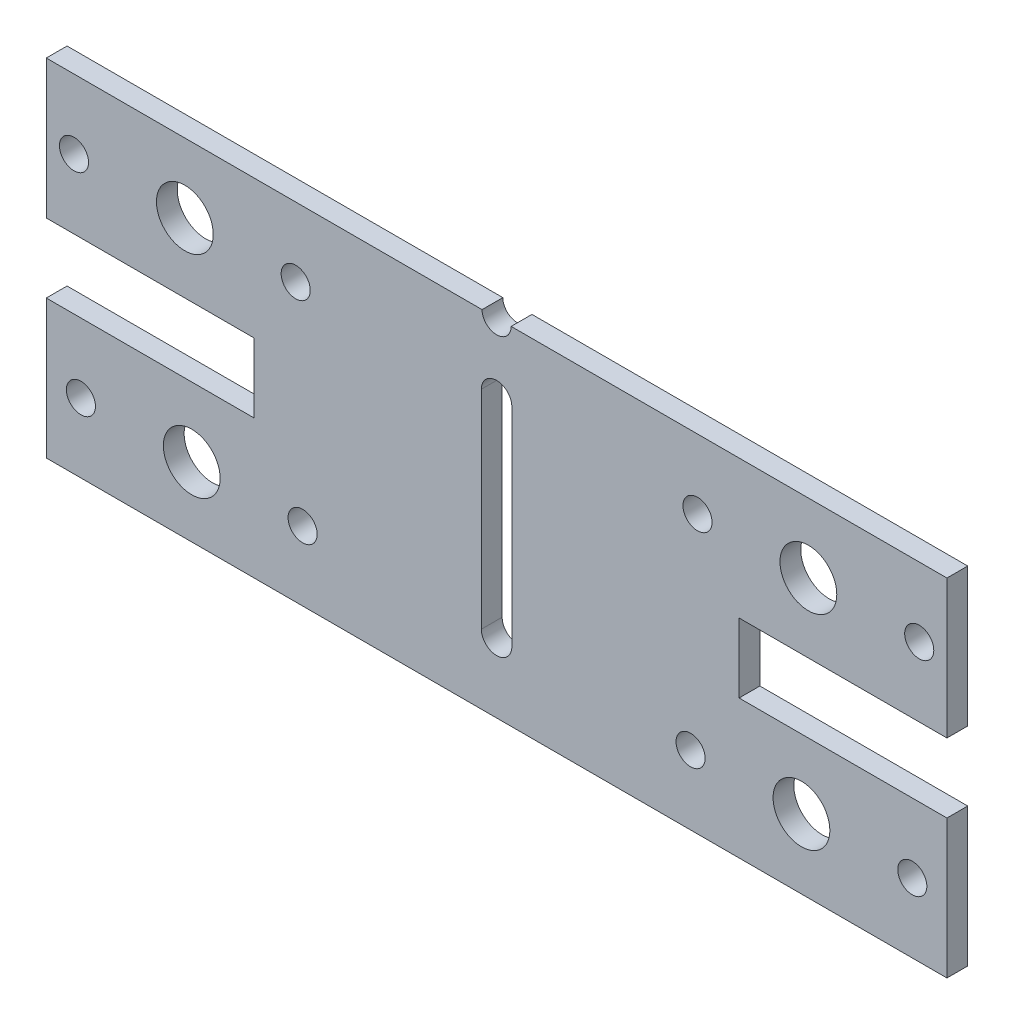
ISO-10303-21;
HEADER;
FILE_DESCRIPTION(('STEP AP214'),'2;1');
FILE_NAME('part.step','',(''),(''),'','','');
FILE_SCHEMA(('AUTOMOTIVE_DESIGN { 1 0 10303 214 1 1 1 1 }'));
ENDSEC;
DATA;
#1=APPLICATION_CONTEXT('core data for automotive mechanical design processes');
#2=APPLICATION_PROTOCOL_DEFINITION('international standard','automotive_design',2000,#1);
#3=PRODUCT_CONTEXT('',#1,'mechanical');
#4=PRODUCT('Part','Part','',(#3));
#5=PRODUCT_RELATED_PRODUCT_CATEGORY('part','',(#4));
#6=PRODUCT_DEFINITION_FORMATION('','',#4);
#7=PRODUCT_DEFINITION_CONTEXT('part definition',#1,'design');
#8=PRODUCT_DEFINITION('design','',#6,#7);
#9=PRODUCT_DEFINITION_SHAPE('','',#8);
#10=(LENGTH_UNIT() NAMED_UNIT(*) SI_UNIT(.MILLI.,.METRE.));
#11=(NAMED_UNIT(*) PLANE_ANGLE_UNIT() SI_UNIT($,.RADIAN.));
#12=(NAMED_UNIT(*) SI_UNIT($,.STERADIAN.) SOLID_ANGLE_UNIT());
#13=UNCERTAINTY_MEASURE_WITH_UNIT(LENGTH_MEASURE(1.E-05),#10,'distance_accuracy_value','');
#14=(GEOMETRIC_REPRESENTATION_CONTEXT(3) GLOBAL_UNCERTAINTY_ASSIGNED_CONTEXT((#13)) GLOBAL_UNIT_ASSIGNED_CONTEXT((#10,
#11,#12)) REPRESENTATION_CONTEXT('',''));
#15=CARTESIAN_POINT('',(0.,0.,0.));
#16=DIRECTION('',(0.,0.,1.));
#17=DIRECTION('',(1.,0.,0.));
#18=AXIS2_PLACEMENT_3D('',#15,#16,#17);
#19=CARTESIAN_POINT('',(0.,0.,3.));
#20=DIRECTION('',(1.,0.,0.));
#21=DIRECTION('',(0.,0.,-1.));
#22=AXIS2_PLACEMENT_3D('',#19,#20,#21);
#23=PLANE('',#22);
#24=DIRECTION('',(0.,-1.,0.));
#25=VECTOR('',#24,1.);
#26=CARTESIAN_POINT('',(0.,0.,3.));
#27=LINE('',#26,#25);
#28=CARTESIAN_POINT('',(0.,20.,3.));
#29=VERTEX_POINT('',#28);
#30=CARTESIAN_POINT('',(0.,0.,3.));
#31=VERTEX_POINT('',#30);
#32=EDGE_CURVE('E199',#29,#31,#27,.T.);
#33=ORIENTED_EDGE('',*,*,#32,.F.);
#34=DIRECTION('',(0.,0.,-1.));
#35=VECTOR('',#34,1.);
#36=CARTESIAN_POINT('',(0.,20.,3.001));
#37=LINE('',#36,#35);
#38=CARTESIAN_POINT('',(0.,20.,0.));
#39=VERTEX_POINT('',#38);
#40=EDGE_CURVE('E385',#29,#39,#37,.T.);
#41=ORIENTED_EDGE('',*,*,#40,.T.);
#42=DIRECTION('',(0.,-1.,0.));
#43=VECTOR('',#42,1.);
#44=CARTESIAN_POINT('',(0.,0.,0.));
#45=LINE('',#44,#43);
#46=CARTESIAN_POINT('',(0.,0.,0.));
#47=VERTEX_POINT('',#46);
#48=EDGE_CURVE('E183',#39,#47,#45,.T.);
#49=ORIENTED_EDGE('',*,*,#48,.T.);
#50=DIRECTION('',(0.,0.,-1.));
#51=VECTOR('',#50,1.);
#52=CARTESIAN_POINT('',(0.,0.,3.));
#53=LINE('',#52,#51);
#54=EDGE_CURVE('E11',#31,#47,#53,.T.);
#55=ORIENTED_EDGE('',*,*,#54,.F.);
#56=EDGE_LOOP('',(#33,#41,#49,#55));
#57=FACE_BOUND('',#56,.T.);
#58=ADVANCED_FACE('F33',(#57),#23,.F.);
#59=CARTESIAN_POINT('',(130.,0.,3.));
#60=DIRECTION('',(-1.,0.,0.));
#61=DIRECTION('',(0.,0.,1.));
#62=AXIS2_PLACEMENT_3D('',#59,#60,#61);
#63=PLANE('',#62);
#64=DIRECTION('',(0.,1.,0.));
#65=VECTOR('',#64,1.);
#66=CARTESIAN_POINT('',(130.,0.,3.));
#67=LINE('',#66,#65);
#68=CARTESIAN_POINT('',(130.,30.,3.));
#69=VERTEX_POINT('',#68);
#70=CARTESIAN_POINT('',(130.,50.,3.));
#71=VERTEX_POINT('',#70);
#72=EDGE_CURVE('E357',#69,#71,#67,.T.);
#73=ORIENTED_EDGE('',*,*,#72,.F.);
#74=DIRECTION('',(0.,0.,-1.));
#75=VECTOR('',#74,1.);
#76=CARTESIAN_POINT('',(130.,30.,3.001));
#77=LINE('',#76,#75);
#78=CARTESIAN_POINT('',(130.,30.,0.));
#79=VERTEX_POINT('',#78);
#80=EDGE_CURVE('E233',#69,#79,#77,.T.);
#81=ORIENTED_EDGE('',*,*,#80,.T.);
#82=DIRECTION('',(0.,1.,0.));
#83=VECTOR('',#82,1.);
#84=CARTESIAN_POINT('',(130.,0.,0.));
#85=LINE('',#84,#83);
#86=CARTESIAN_POINT('',(130.,50.,0.));
#87=VERTEX_POINT('',#86);
#88=EDGE_CURVE('E185',#79,#87,#85,.T.);
#89=ORIENTED_EDGE('',*,*,#88,.T.);
#90=DIRECTION('',(0.,0.,-1.));
#91=VECTOR('',#90,1.);
#92=CARTESIAN_POINT('',(130.,50.,3.));
#93=LINE('',#92,#91);
#94=EDGE_CURVE('E201',#71,#87,#93,.T.);
#95=ORIENTED_EDGE('',*,*,#94,.F.);
#96=EDGE_LOOP('',(#73,#81,#89,#95));
#97=FACE_BOUND('',#96,.T.);
#98=ADVANCED_FACE('F371',(#97),#63,.F.);
#99=CARTESIAN_POINT('',(0.,50.,3.));
#100=DIRECTION('',(0.,-1.,0.));
#101=DIRECTION('',(0.,0.,-1.));
#102=AXIS2_PLACEMENT_3D('',#99,#100,#101);
#103=PLANE('',#102);
#104=DIRECTION('',(-1.,0.,0.));
#105=VECTOR('',#104,1.);
#106=CARTESIAN_POINT('',(0.,50.,3.));
#107=LINE('',#106,#105);
#108=CARTESIAN_POINT('',(62.9,50.,3.));
#109=VERTEX_POINT('',#108);
#110=CARTESIAN_POINT('',(0.,50.,3.));
#111=VERTEX_POINT('',#110);
#112=EDGE_CURVE('E358',#109,#111,#107,.T.);
#113=ORIENTED_EDGE('',*,*,#112,.F.);
#114=DIRECTION('',(0.,0.,-1.));
#115=VECTOR('',#114,1.);
#116=CARTESIAN_POINT('',(62.9,50.,3.001));
#117=LINE('',#116,#115);
#118=CARTESIAN_POINT('',(62.9,50.,0.));
#119=VERTEX_POINT('',#118);
#120=EDGE_CURVE('E247',#109,#119,#117,.T.);
#121=ORIENTED_EDGE('',*,*,#120,.T.);
#122=DIRECTION('',(-1.,0.,0.));
#123=VECTOR('',#122,1.);
#124=CARTESIAN_POINT('',(0.,50.,0.));
#125=LINE('',#124,#123);
#126=CARTESIAN_POINT('',(0.,50.,0.));
#127=VERTEX_POINT('',#126);
#128=EDGE_CURVE('E195',#119,#127,#125,.T.);
#129=ORIENTED_EDGE('',*,*,#128,.T.);
#130=DIRECTION('',(0.,0.,-1.));
#131=VECTOR('',#130,1.);
#132=CARTESIAN_POINT('',(0.,50.,3.));
#133=LINE('',#132,#131);
#134=EDGE_CURVE('E181',#111,#127,#133,.T.);
#135=ORIENTED_EDGE('',*,*,#134,.F.);
#136=EDGE_LOOP('',(#113,#121,#129,#135));
#137=FACE_BOUND('',#136,.T.);
#138=ADVANCED_FACE('F382',(#137),#103,.F.);
#139=CARTESIAN_POINT('',(0.,0.,3.));
#140=DIRECTION('',(0.,0.,-1.));
#141=DIRECTION('',(-1.,0.,0.));
#142=AXIS2_PLACEMENT_3D('',#139,#140,#141);
#143=PLANE('',#142);
#144=CARTESIAN_POINT('',(4.,40.,3.));
#145=DIRECTION('',(0.,0.,1.));
#146=DIRECTION('',(1.,0.,0.));
#147=AXIS2_PLACEMENT_3D('',#144,#145,#146);
#148=CIRCLE('',#147,2.1);
#149=CARTESIAN_POINT('',(6.1,40.,3.));
#150=VERTEX_POINT('',#149);
#151=EDGE_CURVE('E187',#150,#150,#148,.T.);
#152=ORIENTED_EDGE('',*,*,#151,.F.);
#153=EDGE_LOOP('',(#152));
#154=FACE_BOUND('',#153,.T.);
#155=DIRECTION('',(0.,1.,0.));
#156=VECTOR('',#155,1.);
#157=CARTESIAN_POINT('',(30.,20.,3.));
#158=LINE('',#157,#156);
#159=CARTESIAN_POINT('',(30.,20.,3.));
#160=VERTEX_POINT('',#159);
#161=CARTESIAN_POINT('',(30.,30.,3.));
#162=VERTEX_POINT('',#161);
#163=EDGE_CURVE('E242',#160,#162,#158,.T.);
#164=ORIENTED_EDGE('',*,*,#163,.F.);
#165=DIRECTION('',(1.,0.,0.));
#166=VECTOR('',#165,1.);
#167=CARTESIAN_POINT('',(0.,20.,3.));
#168=LINE('',#167,#166);
#169=EDGE_CURVE('E177',#29,#160,#168,.T.);
#170=ORIENTED_EDGE('',*,*,#169,.F.);
#171=ORIENTED_EDGE('',*,*,#32,.T.);
#172=DIRECTION('',(1.,0.,0.));
#173=VECTOR('',#172,1.);
#174=CARTESIAN_POINT('',(0.,0.,3.));
#175=LINE('',#174,#173);
#176=CARTESIAN_POINT('',(130.,0.,3.));
#177=VERTEX_POINT('',#176);
#178=EDGE_CURVE('E356',#31,#177,#175,.T.);
#179=ORIENTED_EDGE('',*,*,#178,.T.);
#180=CARTESIAN_POINT('',(130.,20.,3.));
#181=VERTEX_POINT('',#180);
#182=EDGE_CURVE('E210',#177,#181,#67,.T.);
#183=ORIENTED_EDGE('',*,*,#182,.T.);
#184=DIRECTION('',(1.,0.,0.));
#185=VECTOR('',#184,1.);
#186=CARTESIAN_POINT('',(130.,20.,3.));
#187=LINE('',#186,#185);
#188=CARTESIAN_POINT('',(100.,20.,3.));
#189=VERTEX_POINT('',#188);
#190=EDGE_CURVE('E56',#189,#181,#187,.T.);
#191=ORIENTED_EDGE('',*,*,#190,.F.);
#192=DIRECTION('',(0.,-1.,0.));
#193=VECTOR('',#192,1.);
#194=CARTESIAN_POINT('',(100.,20.,3.));
#195=LINE('',#194,#193);
#196=CARTESIAN_POINT('',(100.,30.,3.));
#197=VERTEX_POINT('',#196);
#198=EDGE_CURVE('E227',#197,#189,#195,.T.);
#199=ORIENTED_EDGE('',*,*,#198,.F.);
#200=DIRECTION('',(-1.,0.,0.));
#201=VECTOR('',#200,1.);
#202=CARTESIAN_POINT('',(130.,30.,3.));
#203=LINE('',#202,#201);
#204=EDGE_CURVE('E222',#69,#197,#203,.T.);
#205=ORIENTED_EDGE('',*,*,#204,.F.);
#206=ORIENTED_EDGE('',*,*,#72,.T.);
#207=CARTESIAN_POINT('',(67.1,50.,3.));
#208=VERTEX_POINT('',#207);
#209=EDGE_CURVE('E189',#71,#208,#107,.T.);
#210=ORIENTED_EDGE('',*,*,#209,.T.);
#211=CARTESIAN_POINT('',(65.,50.,3.));
#212=DIRECTION('',(0.,0.,-1.));
#213=DIRECTION('',(-1.,0.,0.));
#214=AXIS2_PLACEMENT_3D('',#211,#212,#213);
#215=CIRCLE('',#214,2.1);
#216=EDGE_CURVE('E243',#109,#208,#215,.F.);
#217=ORIENTED_EDGE('',*,*,#216,.F.);
#218=ORIENTED_EDGE('',*,*,#112,.T.);
#219=CARTESIAN_POINT('',(0.,30.,3.));
#220=VERTEX_POINT('',#219);
#221=EDGE_CURVE('E354',#111,#220,#27,.T.);
#222=ORIENTED_EDGE('',*,*,#221,.T.);
#223=DIRECTION('',(-1.,0.,0.));
#224=VECTOR('',#223,1.);
#225=CARTESIAN_POINT('',(0.,30.,3.));
#226=LINE('',#225,#224);
#227=EDGE_CURVE('E48',#162,#220,#226,.T.);
#228=ORIENTED_EDGE('',*,*,#227,.F.);
#229=EDGE_LOOP('',(#164,#170,#171,#179,#183,#191,#199,#205,#206,#210,#217,#218,#222,#228));
#230=FACE_BOUND('',#229,.T.);
#231=CARTESIAN_POINT('',(65.,10.,3.));
#232=DIRECTION('',(0.,0.,1.));
#233=DIRECTION('',(1.,0.,0.));
#234=AXIS2_PLACEMENT_3D('',#231,#232,#233);
#235=CIRCLE('',#234,2.19999999999999);
#236=CARTESIAN_POINT('',(62.8,10.,3.));
#237=VERTEX_POINT('',#236);
#238=CARTESIAN_POINT('',(67.2,10.,3.));
#239=VERTEX_POINT('',#238);
#240=EDGE_CURVE('E319',#237,#239,#235,.T.);
#241=ORIENTED_EDGE('',*,*,#240,.F.);
#242=DIRECTION('',(0.,-1.,0.));
#243=VECTOR('',#242,1.);
#244=CARTESIAN_POINT('',(62.8,10.,3.));
#245=LINE('',#244,#243);
#246=CARTESIAN_POINT('',(62.8,40.,3.));
#247=VERTEX_POINT('',#246);
#248=EDGE_CURVE('E327',#247,#237,#245,.T.);
#249=ORIENTED_EDGE('',*,*,#248,.F.);
#250=CARTESIAN_POINT('',(65.,40.,3.));
#251=DIRECTION('',(0.,0.,1.));
#252=DIRECTION('',(1.,0.,0.));
#253=AXIS2_PLACEMENT_3D('',#250,#251,#252);
#254=CIRCLE('',#253,2.19999999999998);
#255=CARTESIAN_POINT('',(67.2,40.,3.));
#256=VERTEX_POINT('',#255);
#257=EDGE_CURVE('E324',#256,#247,#254,.T.);
#258=ORIENTED_EDGE('',*,*,#257,.F.);
#259=DIRECTION('',(0.,1.,0.));
#260=VECTOR('',#259,1.);
#261=CARTESIAN_POINT('',(67.2,10.,3.));
#262=LINE('',#261,#260);
#263=EDGE_CURVE('E321',#239,#256,#262,.T.);
#264=ORIENTED_EDGE('',*,*,#263,.F.);
#265=EDGE_LOOP('',(#241,#249,#258,#264));
#266=FACE_BOUND('',#265,.T.);
#267=CARTESIAN_POINT('',(20.,40.,3.));
#268=DIRECTION('',(0.,0.,1.));
#269=DIRECTION('',(1.,0.,0.));
#270=AXIS2_PLACEMENT_3D('',#267,#268,#269);
#271=CIRCLE('',#270,4.10000000000001);
#272=CARTESIAN_POINT('',(24.1,40.,3.));
#273=VERTEX_POINT('',#272);
#274=EDGE_CURVE('E313',#273,#273,#271,.T.);
#275=ORIENTED_EDGE('',*,*,#274,.F.);
#276=EDGE_LOOP('',(#275));
#277=FACE_BOUND('',#276,.T.);
#278=CARTESIAN_POINT('',(36.,40.,3.));
#279=DIRECTION('',(0.,0.,1.));
#280=DIRECTION('',(1.,0.,0.));
#281=AXIS2_PLACEMENT_3D('',#278,#279,#280);
#282=CIRCLE('',#281,2.1);
#283=CARTESIAN_POINT('',(38.1,40.,3.));
#284=VERTEX_POINT('',#283);
#285=EDGE_CURVE('E307',#284,#284,#282,.T.);
#286=ORIENTED_EDGE('',*,*,#285,.F.);
#287=EDGE_LOOP('',(#286));
#288=FACE_BOUND('',#287,.T.);
#289=CARTESIAN_POINT('',(94.,40.,3.));
#290=DIRECTION('',(0.,0.,1.));
#291=DIRECTION('',(1.,0.,0.));
#292=AXIS2_PLACEMENT_3D('',#289,#290,#291);
#293=CIRCLE('',#292,2.1);
#294=CARTESIAN_POINT('',(96.1,40.,3.));
#295=VERTEX_POINT('',#294);
#296=EDGE_CURVE('E301',#295,#295,#293,.T.);
#297=ORIENTED_EDGE('',*,*,#296,.F.);
#298=EDGE_LOOP('',(#297));
#299=FACE_BOUND('',#298,.T.);
#300=CARTESIAN_POINT('',(110.,40.,3.));
#301=DIRECTION('',(0.,0.,1.));
#302=DIRECTION('',(1.,0.,0.));
#303=AXIS2_PLACEMENT_3D('',#300,#301,#302);
#304=CIRCLE('',#303,4.1);
#305=CARTESIAN_POINT('',(114.1,40.,3.));
#306=VERTEX_POINT('',#305);
#307=EDGE_CURVE('E295',#306,#306,#304,.T.);
#308=ORIENTED_EDGE('',*,*,#307,.F.);
#309=EDGE_LOOP('',(#308));
#310=FACE_BOUND('',#309,.T.);
#311=CARTESIAN_POINT('',(126.,40.,3.));
#312=DIRECTION('',(0.,0.,1.));
#313=DIRECTION('',(1.,0.,0.));
#314=AXIS2_PLACEMENT_3D('',#311,#312,#313);
#315=CIRCLE('',#314,2.09999999999999);
#316=CARTESIAN_POINT('',(128.1,40.,3.));
#317=VERTEX_POINT('',#316);
#318=EDGE_CURVE('E289',#317,#317,#315,.T.);
#319=ORIENTED_EDGE('',*,*,#318,.F.);
#320=EDGE_LOOP('',(#319));
#321=FACE_BOUND('',#320,.T.);
#322=CARTESIAN_POINT('',(5.,9.99999999999998,3.));
#323=DIRECTION('',(0.,0.,1.));
#324=DIRECTION('',(1.,0.,0.));
#325=AXIS2_PLACEMENT_3D('',#322,#323,#324);
#326=CIRCLE('',#325,2.1);
#327=CARTESIAN_POINT('',(7.1,9.99999999999998,3.));
#328=VERTEX_POINT('',#327);
#329=EDGE_CURVE('E283',#328,#328,#326,.T.);
#330=ORIENTED_EDGE('',*,*,#329,.F.);
#331=EDGE_LOOP('',(#330));
#332=FACE_BOUND('',#331,.T.);
#333=CARTESIAN_POINT('',(21.,9.99999999999998,3.));
#334=DIRECTION('',(0.,0.,1.));
#335=DIRECTION('',(1.,0.,0.));
#336=AXIS2_PLACEMENT_3D('',#333,#334,#335);
#337=CIRCLE('',#336,4.1);
#338=CARTESIAN_POINT('',(25.1,9.99999999999998,3.));
#339=VERTEX_POINT('',#338);
#340=EDGE_CURVE('E277',#339,#339,#337,.T.);
#341=ORIENTED_EDGE('',*,*,#340,.F.);
#342=EDGE_LOOP('',(#341));
#343=FACE_BOUND('',#342,.T.);
#344=CARTESIAN_POINT('',(37.,9.99999999999999,3.));
#345=DIRECTION('',(0.,0.,1.));
#346=DIRECTION('',(1.,0.,0.));
#347=AXIS2_PLACEMENT_3D('',#344,#345,#346);
#348=CIRCLE('',#347,2.1);
#349=CARTESIAN_POINT('',(39.1,9.99999999999999,3.));
#350=VERTEX_POINT('',#349);
#351=EDGE_CURVE('E271',#350,#350,#348,.T.);
#352=ORIENTED_EDGE('',*,*,#351,.F.);
#353=EDGE_LOOP('',(#352));
#354=FACE_BOUND('',#353,.T.);
#355=CARTESIAN_POINT('',(93.,9.99999999999999,3.));
#356=DIRECTION('',(0.,0.,1.));
#357=DIRECTION('',(1.,0.,0.));
#358=AXIS2_PLACEMENT_3D('',#355,#356,#357);
#359=CIRCLE('',#358,2.1);
#360=CARTESIAN_POINT('',(95.1,9.99999999999999,3.));
#361=VERTEX_POINT('',#360);
#362=EDGE_CURVE('E265',#361,#361,#359,.T.);
#363=ORIENTED_EDGE('',*,*,#362,.F.);
#364=EDGE_LOOP('',(#363));
#365=FACE_BOUND('',#364,.T.);
#366=CARTESIAN_POINT('',(109.,9.99999999999999,3.));
#367=DIRECTION('',(0.,0.,1.));
#368=DIRECTION('',(1.,0.,0.));
#369=AXIS2_PLACEMENT_3D('',#366,#367,#368);
#370=CIRCLE('',#369,4.1);
#371=CARTESIAN_POINT('',(113.1,9.99999999999999,3.));
#372=VERTEX_POINT('',#371);
#373=EDGE_CURVE('E259',#372,#372,#370,.T.);
#374=ORIENTED_EDGE('',*,*,#373,.F.);
#375=EDGE_LOOP('',(#374));
#376=FACE_BOUND('',#375,.T.);
#377=CARTESIAN_POINT('',(125.,9.99999999999999,3.));
#378=DIRECTION('',(0.,0.,1.));
#379=DIRECTION('',(1.,0.,0.));
#380=AXIS2_PLACEMENT_3D('',#377,#378,#379);
#381=CIRCLE('',#380,2.09999999999999);
#382=CARTESIAN_POINT('',(127.1,9.99999999999999,3.));
#383=VERTEX_POINT('',#382);
#384=EDGE_CURVE('E252',#383,#383,#381,.T.);
#385=ORIENTED_EDGE('',*,*,#384,.F.);
#386=EDGE_LOOP('',(#385));
#387=FACE_BOUND('',#386,.T.);
#388=ADVANCED_FACE('F365',(#154,#230,#266,#277,#288,#299,#310,#321,#332,#343,#354,#365,#376,
#387),#143,.F.);
#389=CARTESIAN_POINT('',(0.,0.,0.));
#390=DIRECTION('',(0.,0.,-1.));
#391=DIRECTION('',(-1.,0.,0.));
#392=AXIS2_PLACEMENT_3D('',#389,#390,#391);
#393=PLANE('',#392);
#394=DIRECTION('',(-1.,0.,0.));
#395=VECTOR('',#394,1.);
#396=CARTESIAN_POINT('',(0.,20.,0.));
#397=LINE('',#396,#395);
#398=CARTESIAN_POINT('',(30.,20.,0.));
#399=VERTEX_POINT('',#398);
#400=EDGE_CURVE('E166',#399,#39,#397,.T.);
#401=ORIENTED_EDGE('',*,*,#400,.F.);
#402=DIRECTION('',(0.,-1.,0.));
#403=VECTOR('',#402,1.);
#404=CARTESIAN_POINT('',(30.,20.,0.));
#405=LINE('',#404,#403);
#406=CARTESIAN_POINT('',(30.,30.,0.));
#407=VERTEX_POINT('',#406);
#408=EDGE_CURVE('E176',#407,#399,#405,.T.);
#409=ORIENTED_EDGE('',*,*,#408,.F.);
#410=DIRECTION('',(1.,0.,0.));
#411=VECTOR('',#410,1.);
#412=CARTESIAN_POINT('',(0.,30.,0.));
#413=LINE('',#412,#411);
#414=CARTESIAN_POINT('',(0.,30.,0.));
#415=VERTEX_POINT('',#414);
#416=EDGE_CURVE('E159',#415,#407,#413,.T.);
#417=ORIENTED_EDGE('',*,*,#416,.F.);
#418=EDGE_CURVE('E174',#127,#415,#45,.T.);
#419=ORIENTED_EDGE('',*,*,#418,.F.);
#420=ORIENTED_EDGE('',*,*,#128,.F.);
#421=CARTESIAN_POINT('',(65.,50.,0.));
#422=DIRECTION('',(0.,0.,-1.));
#423=DIRECTION('',(-1.,0.,0.));
#424=AXIS2_PLACEMENT_3D('',#421,#422,#423);
#425=CIRCLE('',#424,2.1);
#426=CARTESIAN_POINT('',(67.1,50.,0.));
#427=VERTEX_POINT('',#426);
#428=EDGE_CURVE('E245',#427,#119,#425,.T.);
#429=ORIENTED_EDGE('',*,*,#428,.F.);
#430=EDGE_CURVE('E196',#87,#427,#125,.T.);
#431=ORIENTED_EDGE('',*,*,#430,.F.);
#432=ORIENTED_EDGE('',*,*,#88,.F.);
#433=DIRECTION('',(1.,0.,0.));
#434=VECTOR('',#433,1.);
#435=CARTESIAN_POINT('',(130.,30.,0.));
#436=LINE('',#435,#434);
#437=CARTESIAN_POINT('',(100.,30.,0.));
#438=VERTEX_POINT('',#437);
#439=EDGE_CURVE('E224',#438,#79,#436,.T.);
#440=ORIENTED_EDGE('',*,*,#439,.F.);
#441=DIRECTION('',(0.,1.,0.));
#442=VECTOR('',#441,1.);
#443=CARTESIAN_POINT('',(100.,20.,0.));
#444=LINE('',#443,#442);
#445=CARTESIAN_POINT('',(100.,20.,0.));
#446=VERTEX_POINT('',#445);
#447=EDGE_CURVE('E221',#446,#438,#444,.T.);
#448=ORIENTED_EDGE('',*,*,#447,.F.);
#449=DIRECTION('',(-1.,0.,0.));
#450=VECTOR('',#449,1.);
#451=CARTESIAN_POINT('',(130.,20.,0.));
#452=LINE('',#451,#450);
#453=CARTESIAN_POINT('',(130.,20.,0.));
#454=VERTEX_POINT('',#453);
#455=EDGE_CURVE('E218',#454,#446,#452,.T.);
#456=ORIENTED_EDGE('',*,*,#455,.F.);
#457=CARTESIAN_POINT('',(130.,0.,0.));
#458=VERTEX_POINT('',#457);
#459=EDGE_CURVE('E192',#458,#454,#85,.T.);
#460=ORIENTED_EDGE('',*,*,#459,.F.);
#461=DIRECTION('',(1.,0.,0.));
#462=VECTOR('',#461,1.);
#463=CARTESIAN_POINT('',(0.,0.,0.));
#464=LINE('',#463,#462);
#465=EDGE_CURVE('E182',#47,#458,#464,.T.);
#466=ORIENTED_EDGE('',*,*,#465,.F.);
#467=ORIENTED_EDGE('',*,*,#48,.F.);
#468=EDGE_LOOP('',(#401,#409,#417,#419,#420,#429,#431,#432,#440,#448,#456,#460,#466,#467));
#469=FACE_BOUND('',#468,.T.);
#470=CARTESIAN_POINT('',(109.,9.99999999999999,0.));
#471=DIRECTION('',(0.,0.,1.));
#472=DIRECTION('',(1.,0.,0.));
#473=AXIS2_PLACEMENT_3D('',#470,#471,#472);
#474=CIRCLE('',#473,4.1);
#475=CARTESIAN_POINT('',(113.1,9.99999999999999,0.));
#476=VERTEX_POINT('',#475);
#477=EDGE_CURVE('E255',#476,#476,#474,.T.);
#478=ORIENTED_EDGE('',*,*,#477,.T.);
#479=EDGE_LOOP('',(#478));
#480=FACE_BOUND('',#479,.T.);
#481=CARTESIAN_POINT('',(37.,9.99999999999999,0.));
#482=DIRECTION('',(0.,0.,1.));
#483=DIRECTION('',(1.,0.,0.));
#484=AXIS2_PLACEMENT_3D('',#481,#482,#483);
#485=CIRCLE('',#484,2.1);
#486=CARTESIAN_POINT('',(39.1,9.99999999999999,0.));
#487=VERTEX_POINT('',#486);
#488=EDGE_CURVE('E268',#487,#487,#485,.T.);
#489=ORIENTED_EDGE('',*,*,#488,.T.);
#490=EDGE_LOOP('',(#489));
#491=FACE_BOUND('',#490,.T.);
#492=CARTESIAN_POINT('',(5.,9.99999999999998,0.));
#493=DIRECTION('',(0.,0.,1.));
#494=DIRECTION('',(1.,0.,0.));
#495=AXIS2_PLACEMENT_3D('',#492,#493,#494);
#496=CIRCLE('',#495,2.1);
#497=CARTESIAN_POINT('',(7.1,9.99999999999998,0.));
#498=VERTEX_POINT('',#497);
#499=EDGE_CURVE('E280',#498,#498,#496,.T.);
#500=ORIENTED_EDGE('',*,*,#499,.T.);
#501=EDGE_LOOP('',(#500));
#502=FACE_BOUND('',#501,.T.);
#503=CARTESIAN_POINT('',(110.,40.,0.));
#504=DIRECTION('',(0.,0.,1.));
#505=DIRECTION('',(1.,0.,0.));
#506=AXIS2_PLACEMENT_3D('',#503,#504,#505);
#507=CIRCLE('',#506,4.1);
#508=CARTESIAN_POINT('',(114.1,40.,0.));
#509=VERTEX_POINT('',#508);
#510=EDGE_CURVE('E292',#509,#509,#507,.T.);
#511=ORIENTED_EDGE('',*,*,#510,.T.);
#512=EDGE_LOOP('',(#511));
#513=FACE_BOUND('',#512,.T.);
#514=CARTESIAN_POINT('',(36.,40.,0.));
#515=DIRECTION('',(0.,0.,1.));
#516=DIRECTION('',(1.,0.,0.));
#517=AXIS2_PLACEMENT_3D('',#514,#515,#516);
#518=CIRCLE('',#517,2.1);
#519=CARTESIAN_POINT('',(38.1,40.,0.));
#520=VERTEX_POINT('',#519);
#521=EDGE_CURVE('E304',#520,#520,#518,.T.);
#522=ORIENTED_EDGE('',*,*,#521,.T.);
#523=EDGE_LOOP('',(#522));
#524=FACE_BOUND('',#523,.T.);
#525=DIRECTION('',(0.,-1.,0.));
#526=VECTOR('',#525,1.);
#527=CARTESIAN_POINT('',(62.8,10.,0.));
#528=LINE('',#527,#526);
#529=CARTESIAN_POINT('',(62.8,40.,0.));
#530=VERTEX_POINT('',#529);
#531=CARTESIAN_POINT('',(62.8,10.,0.));
#532=VERTEX_POINT('',#531);
#533=EDGE_CURVE('E322',#530,#532,#528,.T.);
#534=ORIENTED_EDGE('',*,*,#533,.T.);
#535=CARTESIAN_POINT('',(65.,10.,0.));
#536=DIRECTION('',(0.,0.,1.));
#537=DIRECTION('',(1.,0.,0.));
#538=AXIS2_PLACEMENT_3D('',#535,#536,#537);
#539=CIRCLE('',#538,2.19999999999999);
#540=CARTESIAN_POINT('',(67.2,10.,0.));
#541=VERTEX_POINT('',#540);
#542=EDGE_CURVE('E316',#532,#541,#539,.T.);
#543=ORIENTED_EDGE('',*,*,#542,.T.);
#544=DIRECTION('',(0.,1.,0.));
#545=VECTOR('',#544,1.);
#546=CARTESIAN_POINT('',(67.2,10.,0.));
#547=LINE('',#546,#545);
#548=CARTESIAN_POINT('',(67.2,40.,0.));
#549=VERTEX_POINT('',#548);
#550=EDGE_CURVE('E332',#541,#549,#547,.T.);
#551=ORIENTED_EDGE('',*,*,#550,.T.);
#552=CARTESIAN_POINT('',(65.,40.,0.));
#553=DIRECTION('',(0.,0.,1.));
#554=DIRECTION('',(1.,0.,0.));
#555=AXIS2_PLACEMENT_3D('',#552,#553,#554);
#556=CIRCLE('',#555,2.19999999999998);
#557=EDGE_CURVE('E335',#549,#530,#556,.T.);
#558=ORIENTED_EDGE('',*,*,#557,.T.);
#559=EDGE_LOOP('',(#534,#543,#551,#558));
#560=FACE_BOUND('',#559,.T.);
#561=CARTESIAN_POINT('',(4.,40.,0.));
#562=DIRECTION('',(0.,0.,1.));
#563=DIRECTION('',(1.,0.,0.));
#564=AXIS2_PLACEMENT_3D('',#561,#562,#563);
#565=CIRCLE('',#564,2.1);
#566=CARTESIAN_POINT('',(6.1,40.,0.));
#567=VERTEX_POINT('',#566);
#568=EDGE_CURVE('E349',#567,#567,#565,.T.);
#569=ORIENTED_EDGE('',*,*,#568,.T.);
#570=EDGE_LOOP('',(#569));
#571=FACE_BOUND('',#570,.T.);
#572=CARTESIAN_POINT('',(20.,40.,0.));
#573=DIRECTION('',(0.,0.,1.));
#574=DIRECTION('',(1.,0.,0.));
#575=AXIS2_PLACEMENT_3D('',#572,#573,#574);
#576=CIRCLE('',#575,4.10000000000001);
#577=CARTESIAN_POINT('',(24.1,40.,0.));
#578=VERTEX_POINT('',#577);
#579=EDGE_CURVE('E310',#578,#578,#576,.T.);
#580=ORIENTED_EDGE('',*,*,#579,.T.);
#581=EDGE_LOOP('',(#580));
#582=FACE_BOUND('',#581,.T.);
#583=CARTESIAN_POINT('',(94.,40.,0.));
#584=DIRECTION('',(0.,0.,1.));
#585=DIRECTION('',(1.,0.,0.));
#586=AXIS2_PLACEMENT_3D('',#583,#584,#585);
#587=CIRCLE('',#586,2.1);
#588=CARTESIAN_POINT('',(96.1,40.,0.));
#589=VERTEX_POINT('',#588);
#590=EDGE_CURVE('E298',#589,#589,#587,.T.);
#591=ORIENTED_EDGE('',*,*,#590,.T.);
#592=EDGE_LOOP('',(#591));
#593=FACE_BOUND('',#592,.T.);
#594=CARTESIAN_POINT('',(126.,40.,0.));
#595=DIRECTION('',(0.,0.,1.));
#596=DIRECTION('',(1.,0.,0.));
#597=AXIS2_PLACEMENT_3D('',#594,#595,#596);
#598=CIRCLE('',#597,2.09999999999999);
#599=CARTESIAN_POINT('',(128.1,40.,0.));
#600=VERTEX_POINT('',#599);
#601=EDGE_CURVE('E286',#600,#600,#598,.T.);
#602=ORIENTED_EDGE('',*,*,#601,.T.);
#603=EDGE_LOOP('',(#602));
#604=FACE_BOUND('',#603,.T.);
#605=CARTESIAN_POINT('',(21.,9.99999999999998,0.));
#606=DIRECTION('',(0.,0.,1.));
#607=DIRECTION('',(1.,0.,0.));
#608=AXIS2_PLACEMENT_3D('',#605,#606,#607);
#609=CIRCLE('',#608,4.1);
#610=CARTESIAN_POINT('',(25.1,9.99999999999998,0.));
#611=VERTEX_POINT('',#610);
#612=EDGE_CURVE('E274',#611,#611,#609,.T.);
#613=ORIENTED_EDGE('',*,*,#612,.T.);
#614=EDGE_LOOP('',(#613));
#615=FACE_BOUND('',#614,.T.);
#616=CARTESIAN_POINT('',(93.,9.99999999999999,0.));
#617=DIRECTION('',(0.,0.,1.));
#618=DIRECTION('',(1.,0.,0.));
#619=AXIS2_PLACEMENT_3D('',#616,#617,#618);
#620=CIRCLE('',#619,2.1);
#621=CARTESIAN_POINT('',(95.1,9.99999999999999,0.));
#622=VERTEX_POINT('',#621);
#623=EDGE_CURVE('E262',#622,#622,#620,.T.);
#624=ORIENTED_EDGE('',*,*,#623,.T.);
#625=EDGE_LOOP('',(#624));
#626=FACE_BOUND('',#625,.T.);
#627=CARTESIAN_POINT('',(125.,9.99999999999999,0.));
#628=DIRECTION('',(0.,0.,1.));
#629=DIRECTION('',(1.,0.,0.));
#630=AXIS2_PLACEMENT_3D('',#627,#628,#629);
#631=CIRCLE('',#630,2.09999999999999);
#632=CARTESIAN_POINT('',(127.1,9.99999999999999,0.));
#633=VERTEX_POINT('',#632);
#634=EDGE_CURVE('E256',#633,#633,#631,.T.);
#635=ORIENTED_EDGE('',*,*,#634,.T.);
#636=EDGE_LOOP('',(#635));
#637=FACE_BOUND('',#636,.T.);
#638=ADVANCED_FACE('F171',(#469,#480,#491,#502,#513,#524,#560,#571,#582,#593,#604,#615,#626,
#637),#393,.T.);
#639=ORIENTED_EDGE('',*,*,#418,.T.);
#640=DIRECTION('',(0.,0.,-1.));
#641=VECTOR('',#640,1.);
#642=CARTESIAN_POINT('',(0.,30.,3.001));
#643=LINE('',#642,#641);
#644=EDGE_CURVE('E156',#220,#415,#643,.T.);
#645=ORIENTED_EDGE('',*,*,#644,.F.);
#646=ORIENTED_EDGE('',*,*,#221,.F.);
#647=ORIENTED_EDGE('',*,*,#134,.T.);
#648=EDGE_LOOP('',(#639,#645,#646,#647));
#649=FACE_BOUND('',#648,.T.);
#650=ADVANCED_FACE('F35',(#649),#23,.F.);
#651=CARTESIAN_POINT('',(0.,0.,3.));
#652=DIRECTION('',(0.,1.,0.));
#653=DIRECTION('',(0.,0.,1.));
#654=AXIS2_PLACEMENT_3D('',#651,#652,#653);
#655=PLANE('',#654);
#656=ORIENTED_EDGE('',*,*,#465,.T.);
#657=DIRECTION('',(0.,0.,-1.));
#658=VECTOR('',#657,1.);
#659=CARTESIAN_POINT('',(130.,0.,3.));
#660=LINE('',#659,#658);
#661=EDGE_CURVE('E41',#177,#458,#660,.T.);
#662=ORIENTED_EDGE('',*,*,#661,.F.);
#663=ORIENTED_EDGE('',*,*,#178,.F.);
#664=ORIENTED_EDGE('',*,*,#54,.T.);
#665=EDGE_LOOP('',(#656,#662,#663,#664));
#666=FACE_BOUND('',#665,.T.);
#667=ADVANCED_FACE('F415',(#666),#655,.F.);
#668=ORIENTED_EDGE('',*,*,#459,.T.);
#669=DIRECTION('',(0.,0.,-1.));
#670=VECTOR('',#669,1.);
#671=CARTESIAN_POINT('',(130.,20.,3.001));
#672=LINE('',#671,#670);
#673=EDGE_CURVE('E232',#181,#454,#672,.T.);
#674=ORIENTED_EDGE('',*,*,#673,.F.);
#675=ORIENTED_EDGE('',*,*,#182,.F.);
#676=ORIENTED_EDGE('',*,*,#661,.T.);
#677=EDGE_LOOP('',(#668,#674,#675,#676));
#678=FACE_BOUND('',#677,.T.);
#679=ADVANCED_FACE('F208',(#678),#63,.F.);
#680=ORIENTED_EDGE('',*,*,#430,.T.);
#681=DIRECTION('',(0.,0.,-1.));
#682=VECTOR('',#681,1.);
#683=CARTESIAN_POINT('',(67.1,50.,3.001));
#684=LINE('',#683,#682);
#685=EDGE_CURVE('E248',#208,#427,#684,.T.);
#686=ORIENTED_EDGE('',*,*,#685,.F.);
#687=ORIENTED_EDGE('',*,*,#209,.F.);
#688=ORIENTED_EDGE('',*,*,#94,.T.);
#689=EDGE_LOOP('',(#680,#686,#687,#688));
#690=FACE_BOUND('',#689,.T.);
#691=ADVANCED_FACE('F376',(#690),#103,.F.);
#692=CARTESIAN_POINT('',(4.,40.,3.));
#693=DIRECTION('',(0.,0.,-1.));
#694=DIRECTION('',(-1.,0.,0.));
#695=AXIS2_PLACEMENT_3D('',#692,#693,#694);
#696=CYLINDRICAL_SURFACE('',#695,2.1);
#697=ORIENTED_EDGE('',*,*,#151,.T.);
#698=EDGE_LOOP('',(#697));
#699=FACE_BOUND('',#698,.T.);
#700=ORIENTED_EDGE('',*,*,#568,.F.);
#701=EDGE_LOOP('',(#700));
#702=FACE_BOUND('',#701,.T.);
#703=ADVANCED_FACE('F429',(#699,#702),#696,.F.);
#704=CARTESIAN_POINT('',(65.,10.,3.));
#705=DIRECTION('',(0.,0.,-1.));
#706=DIRECTION('',(-1.,0.,0.));
#707=AXIS2_PLACEMENT_3D('',#704,#705,#706);
#708=CYLINDRICAL_SURFACE('',#707,2.19999999999999);
#709=ORIENTED_EDGE('',*,*,#542,.F.);
#710=DIRECTION('',(0.,0.,-1.));
#711=VECTOR('',#710,1.);
#712=CARTESIAN_POINT('',(62.8,10.,3.));
#713=LINE('',#712,#711);
#714=EDGE_CURVE('E329',#237,#532,#713,.T.);
#715=ORIENTED_EDGE('',*,*,#714,.F.);
#716=ORIENTED_EDGE('',*,*,#240,.T.);
#717=DIRECTION('',(0.,0.,-1.));
#718=VECTOR('',#717,1.);
#719=CARTESIAN_POINT('',(67.2,10.,3.));
#720=LINE('',#719,#718);
#721=EDGE_CURVE('E346',#239,#541,#720,.T.);
#722=ORIENTED_EDGE('',*,*,#721,.T.);
#723=EDGE_LOOP('',(#709,#715,#716,#722));
#724=FACE_BOUND('',#723,.T.);
#725=ADVANCED_FACE('F446',(#724),#708,.F.);
#726=CARTESIAN_POINT('',(67.2,10.,3.));
#727=DIRECTION('',(-1.,0.,0.));
#728=DIRECTION('',(0.,-1.,0.));
#729=AXIS2_PLACEMENT_3D('',#726,#727,#728);
#730=PLANE('',#729);
#731=ORIENTED_EDGE('',*,*,#550,.F.);
#732=ORIENTED_EDGE('',*,*,#721,.F.);
#733=ORIENTED_EDGE('',*,*,#263,.T.);
#734=DIRECTION('',(0.,0.,-1.));
#735=VECTOR('',#734,1.);
#736=CARTESIAN_POINT('',(67.2,40.,3.));
#737=LINE('',#736,#735);
#738=EDGE_CURVE('E344',#256,#549,#737,.T.);
#739=ORIENTED_EDGE('',*,*,#738,.T.);
#740=EDGE_LOOP('',(#731,#732,#733,#739));
#741=FACE_BOUND('',#740,.T.);
#742=ADVANCED_FACE('F453',(#741),#730,.T.);
#743=CARTESIAN_POINT('',(65.,40.,3.));
#744=DIRECTION('',(0.,0.,-1.));
#745=DIRECTION('',(-1.,0.,0.));
#746=AXIS2_PLACEMENT_3D('',#743,#744,#745);
#747=CYLINDRICAL_SURFACE('',#746,2.19999999999998);
#748=ORIENTED_EDGE('',*,*,#557,.F.);
#749=ORIENTED_EDGE('',*,*,#738,.F.);
#750=ORIENTED_EDGE('',*,*,#257,.T.);
#751=DIRECTION('',(0.,0.,-1.));
#752=VECTOR('',#751,1.);
#753=CARTESIAN_POINT('',(62.8,40.,3.));
#754=LINE('',#753,#752);
#755=EDGE_CURVE('E342',#247,#530,#754,.T.);
#756=ORIENTED_EDGE('',*,*,#755,.T.);
#757=EDGE_LOOP('',(#748,#749,#750,#756));
#758=FACE_BOUND('',#757,.T.);
#759=ADVANCED_FACE('F461',(#758),#747,.F.);
#760=CARTESIAN_POINT('',(62.8,10.,3.));
#761=DIRECTION('',(1.,0.,0.));
#762=DIRECTION('',(0.,0.,-1.));
#763=AXIS2_PLACEMENT_3D('',#760,#761,#762);
#764=PLANE('',#763);
#765=ORIENTED_EDGE('',*,*,#533,.F.);
#766=ORIENTED_EDGE('',*,*,#755,.F.);
#767=ORIENTED_EDGE('',*,*,#248,.T.);
#768=ORIENTED_EDGE('',*,*,#714,.T.);
#769=EDGE_LOOP('',(#765,#766,#767,#768));
#770=FACE_BOUND('',#769,.T.);
#771=ADVANCED_FACE('F469',(#770),#764,.T.);
#772=CARTESIAN_POINT('',(20.,40.,3.));
#773=DIRECTION('',(0.,0.,-1.));
#774=DIRECTION('',(-1.,0.,0.));
#775=AXIS2_PLACEMENT_3D('',#772,#773,#774);
#776=CYLINDRICAL_SURFACE('',#775,4.10000000000001);
#777=ORIENTED_EDGE('',*,*,#274,.T.);
#778=EDGE_LOOP('',(#777));
#779=FACE_BOUND('',#778,.T.);
#780=ORIENTED_EDGE('',*,*,#579,.F.);
#781=EDGE_LOOP('',(#780));
#782=FACE_BOUND('',#781,.T.);
#783=ADVANCED_FACE('F477',(#779,#782),#776,.F.);
#784=CARTESIAN_POINT('',(36.,40.,3.));
#785=DIRECTION('',(0.,0.,-1.));
#786=DIRECTION('',(-1.,0.,0.));
#787=AXIS2_PLACEMENT_3D('',#784,#785,#786);
#788=CYLINDRICAL_SURFACE('',#787,2.1);
#789=ORIENTED_EDGE('',*,*,#285,.T.);
#790=EDGE_LOOP('',(#789));
#791=FACE_BOUND('',#790,.T.);
#792=ORIENTED_EDGE('',*,*,#521,.F.);
#793=EDGE_LOOP('',(#792));
#794=FACE_BOUND('',#793,.T.);
#795=ADVANCED_FACE('F485',(#791,#794),#788,.F.);
#796=CARTESIAN_POINT('',(94.,40.,3.));
#797=DIRECTION('',(0.,0.,-1.));
#798=DIRECTION('',(-1.,0.,0.));
#799=AXIS2_PLACEMENT_3D('',#796,#797,#798);
#800=CYLINDRICAL_SURFACE('',#799,2.1);
#801=ORIENTED_EDGE('',*,*,#296,.T.);
#802=EDGE_LOOP('',(#801));
#803=FACE_BOUND('',#802,.T.);
#804=ORIENTED_EDGE('',*,*,#590,.F.);
#805=EDGE_LOOP('',(#804));
#806=FACE_BOUND('',#805,.T.);
#807=ADVANCED_FACE('F493',(#803,#806),#800,.F.);
#808=CARTESIAN_POINT('',(110.,40.,3.));
#809=DIRECTION('',(0.,0.,-1.));
#810=DIRECTION('',(-1.,0.,0.));
#811=AXIS2_PLACEMENT_3D('',#808,#809,#810);
#812=CYLINDRICAL_SURFACE('',#811,4.1);
#813=ORIENTED_EDGE('',*,*,#307,.T.);
#814=EDGE_LOOP('',(#813));
#815=FACE_BOUND('',#814,.T.);
#816=ORIENTED_EDGE('',*,*,#510,.F.);
#817=EDGE_LOOP('',(#816));
#818=FACE_BOUND('',#817,.T.);
#819=ADVANCED_FACE('F501',(#815,#818),#812,.F.);
#820=CARTESIAN_POINT('',(126.,40.,3.));
#821=DIRECTION('',(0.,0.,-1.));
#822=DIRECTION('',(-1.,0.,0.));
#823=AXIS2_PLACEMENT_3D('',#820,#821,#822);
#824=CYLINDRICAL_SURFACE('',#823,2.09999999999999);
#825=ORIENTED_EDGE('',*,*,#318,.T.);
#826=EDGE_LOOP('',(#825));
#827=FACE_BOUND('',#826,.T.);
#828=ORIENTED_EDGE('',*,*,#601,.F.);
#829=EDGE_LOOP('',(#828));
#830=FACE_BOUND('',#829,.T.);
#831=ADVANCED_FACE('F509',(#827,#830),#824,.F.);
#832=CARTESIAN_POINT('',(5.,9.99999999999998,3.));
#833=DIRECTION('',(0.,0.,-1.));
#834=DIRECTION('',(-1.,0.,0.));
#835=AXIS2_PLACEMENT_3D('',#832,#833,#834);
#836=CYLINDRICAL_SURFACE('',#835,2.1);
#837=ORIENTED_EDGE('',*,*,#329,.T.);
#838=EDGE_LOOP('',(#837));
#839=FACE_BOUND('',#838,.T.);
#840=ORIENTED_EDGE('',*,*,#499,.F.);
#841=EDGE_LOOP('',(#840));
#842=FACE_BOUND('',#841,.T.);
#843=ADVANCED_FACE('F517',(#839,#842),#836,.F.);
#844=CARTESIAN_POINT('',(21.,9.99999999999998,3.));
#845=DIRECTION('',(0.,0.,-1.));
#846=DIRECTION('',(-1.,0.,0.));
#847=AXIS2_PLACEMENT_3D('',#844,#845,#846);
#848=CYLINDRICAL_SURFACE('',#847,4.1);
#849=ORIENTED_EDGE('',*,*,#340,.T.);
#850=EDGE_LOOP('',(#849));
#851=FACE_BOUND('',#850,.T.);
#852=ORIENTED_EDGE('',*,*,#612,.F.);
#853=EDGE_LOOP('',(#852));
#854=FACE_BOUND('',#853,.T.);
#855=ADVANCED_FACE('F525',(#851,#854),#848,.F.);
#856=CARTESIAN_POINT('',(37.,9.99999999999999,3.));
#857=DIRECTION('',(0.,0.,-1.));
#858=DIRECTION('',(-1.,0.,0.));
#859=AXIS2_PLACEMENT_3D('',#856,#857,#858);
#860=CYLINDRICAL_SURFACE('',#859,2.1);
#861=ORIENTED_EDGE('',*,*,#351,.T.);
#862=EDGE_LOOP('',(#861));
#863=FACE_BOUND('',#862,.T.);
#864=ORIENTED_EDGE('',*,*,#488,.F.);
#865=EDGE_LOOP('',(#864));
#866=FACE_BOUND('',#865,.T.);
#867=ADVANCED_FACE('F533',(#863,#866),#860,.F.);
#868=CARTESIAN_POINT('',(93.,9.99999999999999,3.));
#869=DIRECTION('',(0.,0.,-1.));
#870=DIRECTION('',(-1.,0.,0.));
#871=AXIS2_PLACEMENT_3D('',#868,#869,#870);
#872=CYLINDRICAL_SURFACE('',#871,2.1);
#873=ORIENTED_EDGE('',*,*,#362,.T.);
#874=EDGE_LOOP('',(#873));
#875=FACE_BOUND('',#874,.T.);
#876=ORIENTED_EDGE('',*,*,#623,.F.);
#877=EDGE_LOOP('',(#876));
#878=FACE_BOUND('',#877,.T.);
#879=ADVANCED_FACE('F541',(#875,#878),#872,.F.);
#880=CARTESIAN_POINT('',(109.,9.99999999999999,3.));
#881=DIRECTION('',(0.,0.,-1.));
#882=DIRECTION('',(-1.,0.,0.));
#883=AXIS2_PLACEMENT_3D('',#880,#881,#882);
#884=CYLINDRICAL_SURFACE('',#883,4.1);
#885=ORIENTED_EDGE('',*,*,#373,.T.);
#886=EDGE_LOOP('',(#885));
#887=FACE_BOUND('',#886,.T.);
#888=ORIENTED_EDGE('',*,*,#477,.F.);
#889=EDGE_LOOP('',(#888));
#890=FACE_BOUND('',#889,.T.);
#891=ADVANCED_FACE('F549',(#887,#890),#884,.F.);
#892=CARTESIAN_POINT('',(125.,9.99999999999999,3.));
#893=DIRECTION('',(0.,0.,-1.));
#894=DIRECTION('',(-1.,0.,0.));
#895=AXIS2_PLACEMENT_3D('',#892,#893,#894);
#896=CYLINDRICAL_SURFACE('',#895,2.09999999999999);
#897=ORIENTED_EDGE('',*,*,#384,.T.);
#898=EDGE_LOOP('',(#897));
#899=FACE_BOUND('',#898,.T.);
#900=ORIENTED_EDGE('',*,*,#634,.F.);
#901=EDGE_LOOP('',(#900));
#902=FACE_BOUND('',#901,.T.);
#903=ADVANCED_FACE('F404',(#899,#902),#896,.F.);
#904=CARTESIAN_POINT('',(65.,50.,3.001));
#905=DIRECTION('',(0.,0.,-1.));
#906=DIRECTION('',(-1.,0.,0.));
#907=AXIS2_PLACEMENT_3D('',#904,#905,#906);
#908=CYLINDRICAL_SURFACE('',#907,2.1);
#909=ORIENTED_EDGE('',*,*,#216,.T.);
#910=ORIENTED_EDGE('',*,*,#685,.T.);
#911=ORIENTED_EDGE('',*,*,#428,.T.);
#912=ORIENTED_EDGE('',*,*,#120,.F.);
#913=EDGE_LOOP('',(#909,#910,#911,#912));
#914=FACE_BOUND('',#913,.T.);
#915=ADVANCED_FACE('F379',(#914),#908,.F.);
#916=CARTESIAN_POINT('',(130.,30.,3.001));
#917=DIRECTION('',(0.,1.,0.));
#918=DIRECTION('',(-1.,0.,0.));
#919=AXIS2_PLACEMENT_3D('',#916,#917,#918);
#920=PLANE('',#919);
#921=ORIENTED_EDGE('',*,*,#204,.T.);
#922=DIRECTION('',(0.,0.,-1.));
#923=VECTOR('',#922,1.);
#924=CARTESIAN_POINT('',(100.,30.,3.001));
#925=LINE('',#924,#923);
#926=EDGE_CURVE('E236',#197,#438,#925,.T.);
#927=ORIENTED_EDGE('',*,*,#926,.T.);
#928=ORIENTED_EDGE('',*,*,#439,.T.);
#929=ORIENTED_EDGE('',*,*,#80,.F.);
#930=EDGE_LOOP('',(#921,#927,#928,#929));
#931=FACE_BOUND('',#930,.T.);
#932=ADVANCED_FACE('F395',(#931),#920,.F.);
#933=CARTESIAN_POINT('',(100.,20.,3.001));
#934=DIRECTION('',(-1.,0.,0.));
#935=DIRECTION('',(0.,0.,1.));
#936=AXIS2_PLACEMENT_3D('',#933,#934,#935);
#937=PLANE('',#936);
#938=ORIENTED_EDGE('',*,*,#198,.T.);
#939=DIRECTION('',(0.,0.,-1.));
#940=VECTOR('',#939,1.);
#941=CARTESIAN_POINT('',(100.,20.,3.001));
#942=LINE('',#941,#940);
#943=EDGE_CURVE('E238',#189,#446,#942,.T.);
#944=ORIENTED_EDGE('',*,*,#943,.T.);
#945=ORIENTED_EDGE('',*,*,#447,.T.);
#946=ORIENTED_EDGE('',*,*,#926,.F.);
#947=EDGE_LOOP('',(#938,#944,#945,#946));
#948=FACE_BOUND('',#947,.T.);
#949=ADVANCED_FACE('F393',(#948),#937,.F.);
#950=CARTESIAN_POINT('',(130.,20.,3.001));
#951=DIRECTION('',(0.,-1.,0.));
#952=DIRECTION('',(1.,0.,0.));
#953=AXIS2_PLACEMENT_3D('',#950,#951,#952);
#954=PLANE('',#953);
#955=ORIENTED_EDGE('',*,*,#190,.T.);
#956=ORIENTED_EDGE('',*,*,#673,.T.);
#957=ORIENTED_EDGE('',*,*,#455,.T.);
#958=ORIENTED_EDGE('',*,*,#943,.F.);
#959=EDGE_LOOP('',(#955,#956,#957,#958));
#960=FACE_BOUND('',#959,.T.);
#961=ADVANCED_FACE('F402',(#960),#954,.F.);
#962=CARTESIAN_POINT('',(0.,20.,3.001));
#963=DIRECTION('',(0.,-1.,0.));
#964=DIRECTION('',(1.,0.,0.));
#965=AXIS2_PLACEMENT_3D('',#962,#963,#964);
#966=PLANE('',#965);
#967=ORIENTED_EDGE('',*,*,#169,.T.);
#968=DIRECTION('',(0.,0.,-1.));
#969=VECTOR('',#968,1.);
#970=CARTESIAN_POINT('',(30.,20.,3.001));
#971=LINE('',#970,#969);
#972=EDGE_CURVE('E388',#160,#399,#971,.T.);
#973=ORIENTED_EDGE('',*,*,#972,.T.);
#974=ORIENTED_EDGE('',*,*,#400,.T.);
#975=ORIENTED_EDGE('',*,*,#40,.F.);
#976=EDGE_LOOP('',(#967,#973,#974,#975));
#977=FACE_BOUND('',#976,.T.);
#978=ADVANCED_FACE('F588',(#977),#966,.F.);
#979=CARTESIAN_POINT('',(30.,20.,3.001));
#980=DIRECTION('',(1.,0.,0.));
#981=DIRECTION('',(0.,1.,0.));
#982=AXIS2_PLACEMENT_3D('',#979,#980,#981);
#983=PLANE('',#982);
#984=ORIENTED_EDGE('',*,*,#163,.T.);
#985=DIRECTION('',(0.,0.,-1.));
#986=VECTOR('',#985,1.);
#987=CARTESIAN_POINT('',(30.,30.,3.001));
#988=LINE('',#987,#986);
#989=EDGE_CURVE('E165',#162,#407,#988,.T.);
#990=ORIENTED_EDGE('',*,*,#989,.T.);
#991=ORIENTED_EDGE('',*,*,#408,.T.);
#992=ORIENTED_EDGE('',*,*,#972,.F.);
#993=EDGE_LOOP('',(#984,#990,#991,#992));
#994=FACE_BOUND('',#993,.T.);
#995=ADVANCED_FACE('F597',(#994),#983,.F.);
#996=CARTESIAN_POINT('',(0.,30.,3.001));
#997=DIRECTION('',(0.,1.,0.));
#998=DIRECTION('',(-1.,0.,0.));
#999=AXIS2_PLACEMENT_3D('',#996,#997,#998);
#1000=PLANE('',#999);
#1001=ORIENTED_EDGE('',*,*,#227,.T.);
#1002=ORIENTED_EDGE('',*,*,#644,.T.);
#1003=ORIENTED_EDGE('',*,*,#416,.T.);
#1004=ORIENTED_EDGE('',*,*,#989,.F.);
#1005=EDGE_LOOP('',(#1001,#1002,#1003,#1004));
#1006=FACE_BOUND('',#1005,.T.);
#1007=ADVANCED_FACE('F158',(#1006),#1000,.F.);
#1008=CLOSED_SHELL('',(#58,#98,#138,#388,#638,#650,#667,#679,#691,#703,#725,#742,#759,#771,#783,
#795,#807,#819,#831,#843,#855,#867,#879,#891,#903,#915,#932,#949,#961,#978,#995,#1007));
#1009=MANIFOLD_SOLID_BREP('B2',#1008);
#1010=ADVANCED_BREP_SHAPE_REPRESENTATION('',(#18,#1009),#14);
#1011=SHAPE_DEFINITION_REPRESENTATION(#9,#1010);
ENDSEC;
END-ISO-10303-21;
